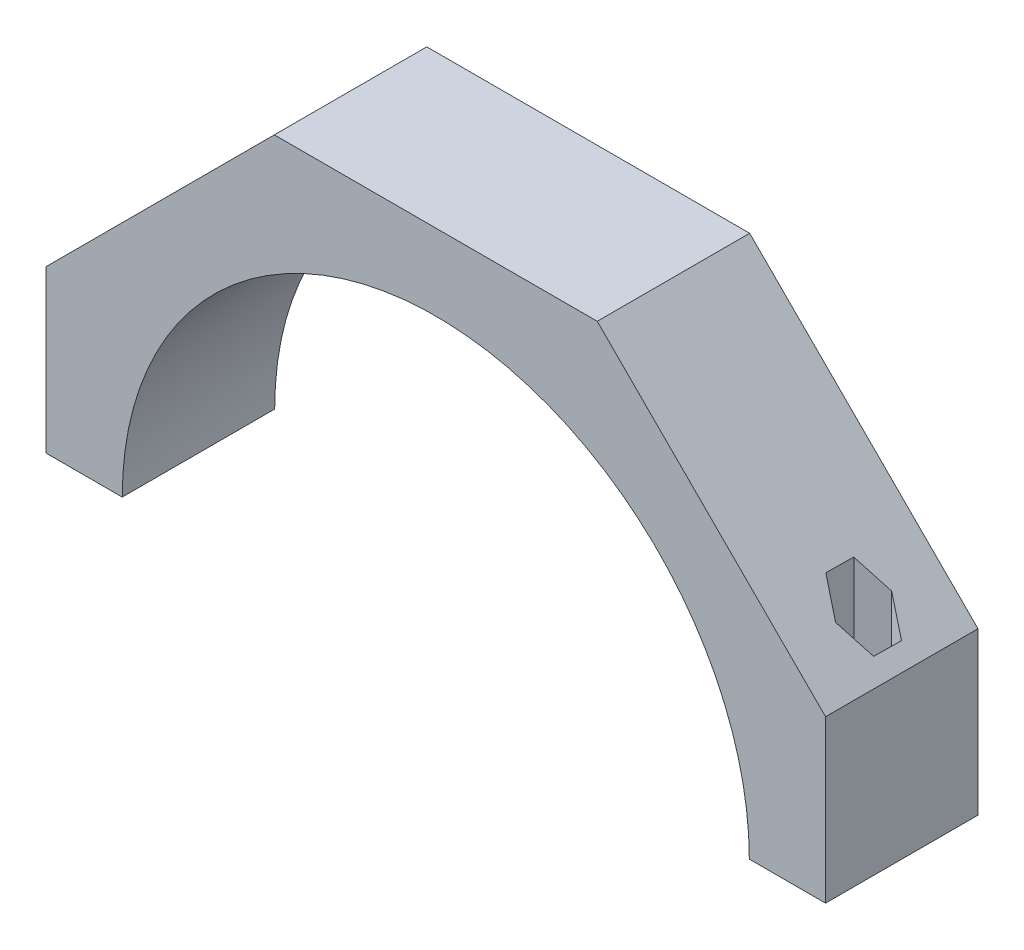
ISO-10303-21;
HEADER;
FILE_DESCRIPTION(('STEP AP214'),'2;1');
FILE_NAME('part.step','',(''),(''),'','','');
FILE_SCHEMA(('AUTOMOTIVE_DESIGN { 1 0 10303 214 1 1 1 1 }'));
ENDSEC;
DATA;
#1=APPLICATION_CONTEXT('core data for automotive mechanical design processes');
#2=APPLICATION_PROTOCOL_DEFINITION('international standard','automotive_design',2000,#1);
#3=PRODUCT_CONTEXT('',#1,'mechanical');
#4=PRODUCT('Part','Part','',(#3));
#5=PRODUCT_RELATED_PRODUCT_CATEGORY('part','',(#4));
#6=PRODUCT_DEFINITION_FORMATION('','',#4);
#7=PRODUCT_DEFINITION_CONTEXT('part definition',#1,'design');
#8=PRODUCT_DEFINITION('design','',#6,#7);
#9=PRODUCT_DEFINITION_SHAPE('','',#8);
#10=(LENGTH_UNIT() NAMED_UNIT(*) SI_UNIT(.MILLI.,.METRE.));
#11=(NAMED_UNIT(*) PLANE_ANGLE_UNIT() SI_UNIT($,.RADIAN.));
#12=(NAMED_UNIT(*) SI_UNIT($,.STERADIAN.) SOLID_ANGLE_UNIT());
#13=UNCERTAINTY_MEASURE_WITH_UNIT(LENGTH_MEASURE(1.E-05),#10,'distance_accuracy_value','');
#14=(GEOMETRIC_REPRESENTATION_CONTEXT(3) GLOBAL_UNCERTAINTY_ASSIGNED_CONTEXT((#13)) GLOBAL_UNIT_ASSIGNED_CONTEXT((#10,
#11,#12)) REPRESENTATION_CONTEXT('',''));
#15=CARTESIAN_POINT('',(0.,0.,0.));
#16=DIRECTION('',(0.,0.,1.));
#17=DIRECTION('',(1.,0.,0.));
#18=AXIS2_PLACEMENT_3D('',#15,#16,#17);
#19=CARTESIAN_POINT('',(0.,0.,19.05));
#20=DIRECTION('',(0.,0.,-1.));
#21=DIRECTION('',(-1.,0.,0.));
#22=AXIS2_PLACEMENT_3D('',#19,#20,#21);
#23=CYLINDRICAL_SURFACE('',#22,78.359);
#24=CARTESIAN_POINT('',(0.,0.,-19.05));
#25=DIRECTION('',(0.,0.,-1.));
#26=DIRECTION('',(1.,0.,0.));
#27=AXIS2_PLACEMENT_3D('',#24,#25,#26);
#28=CIRCLE('',#27,78.359);
#29=CARTESIAN_POINT('',(-78.359,0.,-19.05));
#30=VERTEX_POINT('',#29);
#31=CARTESIAN_POINT('',(78.359,0.,-19.05));
#32=VERTEX_POINT('',#31);
#33=EDGE_CURVE('E144',#30,#32,#28,.T.);
#34=ORIENTED_EDGE('',*,*,#33,.T.);
#35=DIRECTION('',(0.,0.,-1.));
#36=VECTOR('',#35,1.);
#37=CARTESIAN_POINT('',(78.359,0.,19.05));
#38=LINE('',#37,#36);
#39=CARTESIAN_POINT('',(78.359,0.,19.05));
#40=VERTEX_POINT('',#39);
#41=EDGE_CURVE('E173',#40,#32,#38,.T.);
#42=ORIENTED_EDGE('',*,*,#41,.F.);
#43=CARTESIAN_POINT('',(0.,0.,19.05));
#44=DIRECTION('',(0.,0.,-1.));
#45=DIRECTION('',(1.,0.,0.));
#46=AXIS2_PLACEMENT_3D('',#43,#44,#45);
#47=CIRCLE('',#46,78.359);
#48=CARTESIAN_POINT('',(-78.359,0.,19.05));
#49=VERTEX_POINT('',#48);
#50=EDGE_CURVE('E160',#49,#40,#47,.T.);
#51=ORIENTED_EDGE('',*,*,#50,.F.);
#52=DIRECTION('',(0.,0.,-1.));
#53=VECTOR('',#52,1.);
#54=CARTESIAN_POINT('',(-78.359,0.,19.05));
#55=LINE('',#54,#53);
#56=EDGE_CURVE('E140',#49,#30,#55,.T.);
#57=ORIENTED_EDGE('',*,*,#56,.T.);
#58=EDGE_LOOP('',(#34,#42,#51,#57));
#59=FACE_BOUND('',#58,.T.);
#60=ADVANCED_FACE('F36',(#59),#23,.F.);
#61=CARTESIAN_POINT('',(78.359,0.,19.05));
#62=DIRECTION('',(0.,1.,0.));
#63=DIRECTION('',(-1.,0.,0.));
#64=AXIS2_PLACEMENT_3D('',#61,#62,#63);
#65=PLANE('',#64);
#66=CARTESIAN_POINT('',(87.884,0.,0.));
#67=DIRECTION('',(0.,-1.,0.));
#68=DIRECTION('',(0.,0.,-1.));
#69=AXIS2_PLACEMENT_3D('',#66,#67,#68);
#70=CIRCLE('',#69,3.429);
#71=CARTESIAN_POINT('',(87.884,0.,-3.429));
#72=VERTEX_POINT('',#71);
#73=EDGE_CURVE('E186',#72,#72,#70,.T.);
#74=ORIENTED_EDGE('',*,*,#73,.F.);
#75=EDGE_LOOP('',(#74));
#76=FACE_BOUND('',#75,.T.);
#77=DIRECTION('',(1.,0.,0.));
#78=VECTOR('',#77,1.);
#79=CARTESIAN_POINT('',(78.359,0.,-19.05));
#80=LINE('',#79,#78);
#81=CARTESIAN_POINT('',(97.409,0.,-19.05));
#82=VERTEX_POINT('',#81);
#83=EDGE_CURVE('E147',#32,#82,#80,.T.);
#84=ORIENTED_EDGE('',*,*,#83,.T.);
#85=DIRECTION('',(0.,0.,-1.));
#86=VECTOR('',#85,1.);
#87=CARTESIAN_POINT('',(97.409,0.,19.05));
#88=LINE('',#87,#86);
#89=CARTESIAN_POINT('',(97.409,0.,19.05));
#90=VERTEX_POINT('',#89);
#91=EDGE_CURVE('E170',#90,#82,#88,.T.);
#92=ORIENTED_EDGE('',*,*,#91,.F.);
#93=DIRECTION('',(1.,0.,0.));
#94=VECTOR('',#93,1.);
#95=CARTESIAN_POINT('',(78.359,0.,19.05));
#96=LINE('',#95,#94);
#97=EDGE_CURVE('E101',#40,#90,#96,.T.);
#98=ORIENTED_EDGE('',*,*,#97,.F.);
#99=ORIENTED_EDGE('',*,*,#41,.T.);
#100=EDGE_LOOP('',(#84,#92,#98,#99));
#101=FACE_BOUND('',#100,.T.);
#102=ADVANCED_FACE('F263',(#76,#101),#65,.F.);
#103=CARTESIAN_POINT('',(97.409,0.,19.05));
#104=DIRECTION('',(-1.,0.,0.));
#105=DIRECTION('',(0.,0.,1.));
#106=AXIS2_PLACEMENT_3D('',#103,#104,#105);
#107=PLANE('',#106);
#108=DIRECTION('',(0.,1.,0.));
#109=VECTOR('',#108,1.);
#110=CARTESIAN_POINT('',(97.409,0.,-19.05));
#111=LINE('',#110,#109);
#112=CARTESIAN_POINT('',(97.409,40.3481288972009,-19.05));
#113=VERTEX_POINT('',#112);
#114=EDGE_CURVE('E150',#82,#113,#111,.T.);
#115=ORIENTED_EDGE('',*,*,#114,.T.);
#116=DIRECTION('',(0.,0.,-1.));
#117=VECTOR('',#116,1.);
#118=CARTESIAN_POINT('',(97.409,40.3481288972009,19.05));
#119=LINE('',#118,#117);
#120=CARTESIAN_POINT('',(97.409,40.3481288972009,19.05));
#121=VERTEX_POINT('',#120);
#122=EDGE_CURVE('E167',#121,#113,#119,.T.);
#123=ORIENTED_EDGE('',*,*,#122,.F.);
#124=DIRECTION('',(0.,1.,0.));
#125=VECTOR('',#124,1.);
#126=CARTESIAN_POINT('',(97.409,0.,19.05));
#127=LINE('',#126,#125);
#128=EDGE_CURVE('E245',#90,#121,#127,.T.);
#129=ORIENTED_EDGE('',*,*,#128,.F.);
#130=ORIENTED_EDGE('',*,*,#91,.T.);
#131=EDGE_LOOP('',(#115,#123,#129,#130));
#132=FACE_BOUND('',#131,.T.);
#133=ADVANCED_FACE('F266',(#132),#107,.F.);
#134=CARTESIAN_POINT('',(97.409,40.3481288972009,19.05));
#135=DIRECTION('',(-0.707106781186547,-0.707106781186548,0.));
#136=DIRECTION('',(0.707106781186548,-0.707106781186547,0.));
#137=AXIS2_PLACEMENT_3D('',#134,#135,#136);
#138=PLANE('',#137);
#139=DIRECTION('',(0.656228253901727,-0.656228253901725,-0.37246336405368));
#140=VECTOR('',#139,1.);
#141=CARTESIAN_POINT('',(89.7406015644502,48.0165273327507,-7.97128693042852));
#142=LINE('',#141,#140);
#143=CARTESIAN_POINT('',(81.8936901445303,55.8634387526705,-3.51752102273222));
#144=VERTEX_POINT('',#143);
#145=CARTESIAN_POINT('',(87.9351076362971,49.8220212609038,-6.94652102274313));
#146=VERTEX_POINT('',#145);
#147=EDGE_CURVE('E43',#144,#146,#142,.T.);
#148=ORIENTED_EDGE('',*,*,#147,.T.);
#149=DIRECTION('',(0.653050160585475,-0.653050160585473,0.383472261732936));
#150=VECTOR('',#149,1.);
#151=CARTESIAN_POINT('',(102.526075832161,35.2310530650402,1.62132247939293));
#152=LINE('',#151,#150);
#153=CARTESIAN_POINT('',(93.9254174917667,43.8317114054341,-3.42900000001092));
#154=VERTEX_POINT('',#153);
#155=EDGE_CURVE('E11',#146,#154,#152,.T.);
#156=ORIENTED_EDGE('',*,*,#155,.T.);
#157=DIRECTION('',(-0.00735690137628621,0.00735690137628619,0.999945874537357));
#158=VECTOR('',#157,1.);
#159=CARTESIAN_POINT('',(93.7604277475945,43.9967011496064,18.9963127217008));
#160=LINE('',#159,#158);
#161=CARTESIAN_POINT('',(93.8743098554697,43.8828190417312,3.5175210227322));
#162=VERTEX_POINT('',#161);
#163=EDGE_CURVE('E175',#154,#162,#160,.T.);
#164=ORIENTED_EDGE('',*,*,#163,.T.);
#165=DIRECTION('',(-0.656228253901726,0.656228253901725,0.372463364053681));
#166=VECTOR('',#165,1.);
#167=CARTESIAN_POINT('',(93.1221723403449,44.634956556856,3.94442075990246));
#168=LINE('',#167,#166);
#169=CARTESIAN_POINT('',(87.8328923637029,49.9242365334979,6.94652102274312));
#170=VERTEX_POINT('',#169);
#171=EDGE_CURVE('E189',#162,#170,#168,.T.);
#172=ORIENTED_EDGE('',*,*,#171,.T.);
#173=DIRECTION('',(-0.653050160585475,0.653050160585473,-0.383472261732936));
#174=VECTOR('',#173,1.);
#175=CARTESIAN_POINT('',(99.0318573864022,38.7252715107987,13.5225739900564));
#176=LINE('',#175,#174);
#177=CARTESIAN_POINT('',(81.8425825082333,55.9145463889676,3.42900000001091));
#178=VERTEX_POINT('',#177);
#179=EDGE_CURVE('E192',#170,#178,#176,.T.);
#180=ORIENTED_EDGE('',*,*,#179,.T.);
#181=DIRECTION('',(0.0073569013762862,-0.00735690137628618,-0.999945874537357));
#182=VECTOR('',#181,1.);
#183=CARTESIAN_POINT('',(81.7293516055433,56.0277772916575,18.8192802584815));
#184=LINE('',#183,#182);
#185=EDGE_CURVE('E195',#178,#144,#184,.T.);
#186=ORIENTED_EDGE('',*,*,#185,.T.);
#187=EDGE_LOOP('',(#148,#156,#164,#172,#180,#186));
#188=FACE_BOUND('',#187,.T.);
#189=DIRECTION('',(-0.707106781186548,0.707106781186547,0.));
#190=VECTOR('',#189,1.);
#191=CARTESIAN_POINT('',(97.409,40.3481288972009,-19.05));
#192=LINE('',#191,#190);
#193=CARTESIAN_POINT('',(40.3481288972007,97.409,-19.05));
#194=VERTEX_POINT('',#193);
#195=EDGE_CURVE('E152',#113,#194,#192,.T.);
#196=ORIENTED_EDGE('',*,*,#195,.T.);
#197=DIRECTION('',(0.,0.,-1.));
#198=VECTOR('',#197,1.);
#199=CARTESIAN_POINT('',(40.3481288972007,97.409,19.05));
#200=LINE('',#199,#198);
#201=CARTESIAN_POINT('',(40.3481288972007,97.409,19.05));
#202=VERTEX_POINT('',#201);
#203=EDGE_CURVE('E164',#202,#194,#200,.T.);
#204=ORIENTED_EDGE('',*,*,#203,.F.);
#205=DIRECTION('',(-0.707106781186548,0.707106781186547,0.));
#206=VECTOR('',#205,1.);
#207=CARTESIAN_POINT('',(97.409,40.3481288972009,19.05));
#208=LINE('',#207,#206);
#209=EDGE_CURVE('E247',#121,#202,#208,.T.);
#210=ORIENTED_EDGE('',*,*,#209,.F.);
#211=ORIENTED_EDGE('',*,*,#122,.T.);
#212=EDGE_LOOP('',(#196,#204,#210,#211));
#213=FACE_BOUND('',#212,.T.);
#214=ADVANCED_FACE('F200',(#188,#213),#138,.F.);
#215=CARTESIAN_POINT('',(-40.3481288972008,97.409,19.05));
#216=DIRECTION('',(0.,-1.,0.));
#217=DIRECTION('',(0.,0.,-1.));
#218=AXIS2_PLACEMENT_3D('',#215,#216,#217);
#219=PLANE('',#218);
#220=DIRECTION('',(-1.,0.,0.));
#221=VECTOR('',#220,1.);
#222=CARTESIAN_POINT('',(-40.3481288972008,97.409,-19.05));
#223=LINE('',#222,#221);
#224=CARTESIAN_POINT('',(-40.3481288972008,97.409,-19.05));
#225=VERTEX_POINT('',#224);
#226=EDGE_CURVE('E154',#194,#225,#223,.T.);
#227=ORIENTED_EDGE('',*,*,#226,.T.);
#228=DIRECTION('',(0.,0.,-1.));
#229=VECTOR('',#228,1.);
#230=CARTESIAN_POINT('',(-40.3481288972008,97.409,19.05));
#231=LINE('',#230,#229);
#232=CARTESIAN_POINT('',(-40.3481288972008,97.409,19.05));
#233=VERTEX_POINT('',#232);
#234=EDGE_CURVE('E135',#233,#225,#231,.T.);
#235=ORIENTED_EDGE('',*,*,#234,.F.);
#236=DIRECTION('',(-1.,0.,0.));
#237=VECTOR('',#236,1.);
#238=CARTESIAN_POINT('',(-40.3481288972008,97.409,19.05));
#239=LINE('',#238,#237);
#240=EDGE_CURVE('E123',#202,#233,#239,.T.);
#241=ORIENTED_EDGE('',*,*,#240,.F.);
#242=ORIENTED_EDGE('',*,*,#203,.T.);
#243=EDGE_LOOP('',(#227,#235,#241,#242));
#244=FACE_BOUND('',#243,.T.);
#245=ADVANCED_FACE('F255',(#244),#219,.F.);
#246=CARTESIAN_POINT('',(-97.409,40.3481288972009,19.05));
#247=DIRECTION('',(0.707106781186547,-0.707106781186548,0.));
#248=DIRECTION('',(0.707106781186548,0.707106781186547,0.));
#249=AXIS2_PLACEMENT_3D('',#246,#247,#248);
#250=PLANE('',#249);
#251=CARTESIAN_POINT('',(-87.884,49.8731288972009,0.));
#252=DIRECTION('',(0.707106781186547,-0.707106781186548,0.));
#253=DIRECTION('',(-0.707106781186548,-0.707106781186547,0.));
#254=AXIS2_PLACEMENT_3D('',#251,#252,#253);
#255=ELLIPSE('',#254,8.0287082265776,5.67715403118125);
#256=CARTESIAN_POINT('',(-93.5611540311812,44.1959748660196,0.));
#257=VERTEX_POINT('',#256);
#258=EDGE_CURVE('E183',#257,#257,#255,.T.);
#259=ORIENTED_EDGE('',*,*,#258,.T.);
#260=EDGE_LOOP('',(#259));
#261=FACE_BOUND('',#260,.T.);
#262=DIRECTION('',(-0.707106781186548,-0.707106781186547,0.));
#263=VECTOR('',#262,1.);
#264=CARTESIAN_POINT('',(-97.409,40.3481288972009,-19.05));
#265=LINE('',#264,#263);
#266=CARTESIAN_POINT('',(-97.409,40.3481288972009,-19.05));
#267=VERTEX_POINT('',#266);
#268=EDGE_CURVE('E132',#225,#267,#265,.T.);
#269=ORIENTED_EDGE('',*,*,#268,.T.);
#270=DIRECTION('',(0.,0.,-1.));
#271=VECTOR('',#270,1.);
#272=CARTESIAN_POINT('',(-97.409,40.3481288972009,19.05));
#273=LINE('',#272,#271);
#274=CARTESIAN_POINT('',(-97.409,40.3481288972009,19.05));
#275=VERTEX_POINT('',#274);
#276=EDGE_CURVE('E129',#275,#267,#273,.T.);
#277=ORIENTED_EDGE('',*,*,#276,.F.);
#278=DIRECTION('',(-0.707106781186548,-0.707106781186547,0.));
#279=VECTOR('',#278,1.);
#280=CARTESIAN_POINT('',(-97.409,40.3481288972009,19.05));
#281=LINE('',#280,#279);
#282=EDGE_CURVE('E116',#233,#275,#281,.T.);
#283=ORIENTED_EDGE('',*,*,#282,.F.);
#284=ORIENTED_EDGE('',*,*,#234,.T.);
#285=EDGE_LOOP('',(#269,#277,#283,#284));
#286=FACE_BOUND('',#285,.T.);
#287=ADVANCED_FACE('F130',(#261,#286),#250,.F.);
#288=CARTESIAN_POINT('',(-97.409,0.,19.05));
#289=DIRECTION('',(1.,0.,0.));
#290=DIRECTION('',(0.,0.,-1.));
#291=AXIS2_PLACEMENT_3D('',#288,#289,#290);
#292=PLANE('',#291);
#293=DIRECTION('',(0.,-1.,0.));
#294=VECTOR('',#293,1.);
#295=CARTESIAN_POINT('',(-97.409,0.,-19.05));
#296=LINE('',#295,#294);
#297=CARTESIAN_POINT('',(-97.409,0.,-19.05));
#298=VERTEX_POINT('',#297);
#299=EDGE_CURVE('E157',#267,#298,#296,.T.);
#300=ORIENTED_EDGE('',*,*,#299,.T.);
#301=DIRECTION('',(0.,0.,-1.));
#302=VECTOR('',#301,1.);
#303=CARTESIAN_POINT('',(-97.409,0.,19.05));
#304=LINE('',#303,#302);
#305=CARTESIAN_POINT('',(-97.409,0.,19.05));
#306=VERTEX_POINT('',#305);
#307=EDGE_CURVE('E136',#306,#298,#304,.T.);
#308=ORIENTED_EDGE('',*,*,#307,.F.);
#309=DIRECTION('',(0.,-1.,0.));
#310=VECTOR('',#309,1.);
#311=CARTESIAN_POINT('',(-97.409,0.,19.05));
#312=LINE('',#311,#310);
#313=EDGE_CURVE('E120',#275,#306,#312,.T.);
#314=ORIENTED_EDGE('',*,*,#313,.F.);
#315=ORIENTED_EDGE('',*,*,#276,.T.);
#316=EDGE_LOOP('',(#300,#308,#314,#315));
#317=FACE_BOUND('',#316,.T.);
#318=ADVANCED_FACE('F138',(#317),#292,.F.);
#319=CARTESIAN_POINT('',(-78.359,0.,19.05));
#320=DIRECTION('',(0.,1.,0.));
#321=DIRECTION('',(-1.,0.,0.));
#322=AXIS2_PLACEMENT_3D('',#319,#320,#321);
#323=PLANE('',#322);
#324=CARTESIAN_POINT('',(-87.884,0.,0.));
#325=DIRECTION('',(0.,-1.,0.));
#326=DIRECTION('',(0.,0.,-1.));
#327=AXIS2_PLACEMENT_3D('',#324,#325,#326);
#328=CIRCLE('',#327,3.429);
#329=CARTESIAN_POINT('',(-87.884,0.,-3.42900000000002));
#330=VERTEX_POINT('',#329);
#331=EDGE_CURVE('E148',#330,#330,#328,.F.);
#332=ORIENTED_EDGE('',*,*,#331,.T.);
#333=EDGE_LOOP('',(#332));
#334=FACE_BOUND('',#333,.T.);
#335=DIRECTION('',(1.,0.,0.));
#336=VECTOR('',#335,1.);
#337=CARTESIAN_POINT('',(-78.359,0.,-19.05));
#338=LINE('',#337,#336);
#339=EDGE_CURVE('E92',#298,#30,#338,.T.);
#340=ORIENTED_EDGE('',*,*,#339,.T.);
#341=ORIENTED_EDGE('',*,*,#56,.F.);
#342=DIRECTION('',(1.,0.,0.));
#343=VECTOR('',#342,1.);
#344=CARTESIAN_POINT('',(-78.359,0.,19.05));
#345=LINE('',#344,#343);
#346=EDGE_CURVE('E59',#306,#49,#345,.T.);
#347=ORIENTED_EDGE('',*,*,#346,.F.);
#348=ORIENTED_EDGE('',*,*,#307,.T.);
#349=EDGE_LOOP('',(#340,#341,#347,#348));
#350=FACE_BOUND('',#349,.T.);
#351=ADVANCED_FACE('F259',(#334,#350),#323,.F.);
#352=CARTESIAN_POINT('',(0.,0.,19.05));
#353=DIRECTION('',(0.,0.,1.));
#354=DIRECTION('',(1.,0.,0.));
#355=AXIS2_PLACEMENT_3D('',#352,#353,#354);
#356=PLANE('',#355);
#357=ORIENTED_EDGE('',*,*,#50,.T.);
#358=ORIENTED_EDGE('',*,*,#97,.T.);
#359=ORIENTED_EDGE('',*,*,#128,.T.);
#360=ORIENTED_EDGE('',*,*,#209,.T.);
#361=ORIENTED_EDGE('',*,*,#240,.T.);
#362=ORIENTED_EDGE('',*,*,#282,.T.);
#363=ORIENTED_EDGE('',*,*,#313,.T.);
#364=ORIENTED_EDGE('',*,*,#346,.T.);
#365=EDGE_LOOP('',(#357,#358,#359,#360,#361,#362,#363,#364));
#366=FACE_BOUND('',#365,.T.);
#367=ADVANCED_FACE('F118',(#366),#356,.T.);
#368=CARTESIAN_POINT('',(0.,0.,-19.05));
#369=DIRECTION('',(0.,0.,1.));
#370=DIRECTION('',(1.,0.,0.));
#371=AXIS2_PLACEMENT_3D('',#368,#369,#370);
#372=PLANE('',#371);
#373=ORIENTED_EDGE('',*,*,#33,.F.);
#374=ORIENTED_EDGE('',*,*,#339,.F.);
#375=ORIENTED_EDGE('',*,*,#299,.F.);
#376=ORIENTED_EDGE('',*,*,#268,.F.);
#377=ORIENTED_EDGE('',*,*,#226,.F.);
#378=ORIENTED_EDGE('',*,*,#195,.F.);
#379=ORIENTED_EDGE('',*,*,#114,.F.);
#380=ORIENTED_EDGE('',*,*,#83,.F.);
#381=EDGE_LOOP('',(#373,#374,#375,#376,#377,#378,#379,#380));
#382=FACE_BOUND('',#381,.T.);
#383=ADVANCED_FACE('F258',(#382),#372,.F.);
#384=CARTESIAN_POINT('',(-87.884,97.409,0.));
#385=DIRECTION('',(0.,-1.,0.));
#386=DIRECTION('',(0.,0.,-1.));
#387=AXIS2_PLACEMENT_3D('',#384,#385,#386);
#388=CYLINDRICAL_SURFACE('',#387,3.429);
#389=CARTESIAN_POINT('',(-87.884,19.05,0.));
#390=DIRECTION('',(0.,-1.,0.));
#391=DIRECTION('',(0.,0.,-1.));
#392=AXIS2_PLACEMENT_3D('',#389,#390,#391);
#393=CIRCLE('',#392,3.429);
#394=CARTESIAN_POINT('',(-87.884,19.05,-3.42900000000002));
#395=VERTEX_POINT('',#394);
#396=EDGE_CURVE('E179',#395,#395,#393,.T.);
#397=ORIENTED_EDGE('',*,*,#396,.F.);
#398=EDGE_LOOP('',(#397));
#399=FACE_BOUND('',#398,.T.);
#400=ORIENTED_EDGE('',*,*,#331,.F.);
#401=EDGE_LOOP('',(#400));
#402=FACE_BOUND('',#401,.T.);
#403=ADVANCED_FACE('F323',(#399,#402),#388,.F.);
#404=CARTESIAN_POINT('',(87.884,97.409,0.));
#405=DIRECTION('',(0.,-1.,0.));
#406=DIRECTION('',(0.,0.,-1.));
#407=AXIS2_PLACEMENT_3D('',#404,#405,#406);
#408=CYLINDRICAL_SURFACE('',#407,3.429);
#409=CARTESIAN_POINT('',(87.884,19.05,0.));
#410=DIRECTION('',(0.,-1.,0.));
#411=DIRECTION('',(0.,0.,-1.));
#412=AXIS2_PLACEMENT_3D('',#409,#410,#411);
#413=CIRCLE('',#412,3.429);
#414=CARTESIAN_POINT('',(87.884,19.05,-3.429));
#415=VERTEX_POINT('',#414);
#416=EDGE_CURVE('E176',#415,#415,#413,.F.);
#417=ORIENTED_EDGE('',*,*,#416,.T.);
#418=EDGE_LOOP('',(#417));
#419=FACE_BOUND('',#418,.T.);
#420=ORIENTED_EDGE('',*,*,#73,.T.);
#421=EDGE_LOOP('',(#420));
#422=FACE_BOUND('',#421,.T.);
#423=ADVANCED_FACE('F328',(#419,#422),#408,.F.);
#424=CARTESIAN_POINT('',(87.9351076362971,97.409,-6.94652102274313));
#425=DIRECTION('',(0.506357903996156,0.,-0.862323415581775));
#426=DIRECTION('',(-0.862323415581776,0.,-0.506357903996156));
#427=AXIS2_PLACEMENT_3D('',#424,#425,#426);
#428=PLANE('',#427);
#429=DIRECTION('',(0.,-1.,0.));
#430=VECTOR('',#429,1.);
#431=CARTESIAN_POINT('',(87.9351076362971,97.409,-6.94652102274313));
#432=LINE('',#431,#430);
#433=CARTESIAN_POINT('',(87.9351076362971,19.05,-6.94652102274313));
#434=VERTEX_POINT('',#433);
#435=EDGE_CURVE('E216',#146,#434,#432,.T.);
#436=ORIENTED_EDGE('',*,*,#435,.T.);
#437=DIRECTION('',(0.862323415581775,0.,0.506357903996156));
#438=VECTOR('',#437,1.);
#439=CARTESIAN_POINT('',(87.9351076362971,19.05,-6.94652102274313));
#440=LINE('',#439,#438);
#441=CARTESIAN_POINT('',(93.9254174917667,19.05,-3.42900000001092));
#442=VERTEX_POINT('',#441);
#443=EDGE_CURVE('E457',#434,#442,#440,.T.);
#444=ORIENTED_EDGE('',*,*,#443,.T.);
#445=DIRECTION('',(0.,-1.,0.));
#446=VECTOR('',#445,1.);
#447=CARTESIAN_POINT('',(93.9254174917667,97.409,-3.42900000001092));
#448=LINE('',#447,#446);
#449=EDGE_CURVE('E235',#154,#442,#448,.T.);
#450=ORIENTED_EDGE('',*,*,#449,.F.);
#451=ORIENTED_EDGE('',*,*,#155,.F.);
#452=EDGE_LOOP('',(#436,#444,#450,#451));
#453=FACE_BOUND('',#452,.T.);
#454=ADVANCED_FACE('F338',(#453),#428,.F.);
#455=CARTESIAN_POINT('',(81.8936901445303,97.409,-3.51752102273222));
#456=DIRECTION('',(-0.493615032173906,0.,-0.869680516058601));
#457=DIRECTION('',(-0.869680516058601,0.,0.493615032173906));
#458=AXIS2_PLACEMENT_3D('',#455,#456,#457);
#459=PLANE('',#458);
#460=DIRECTION('',(0.,-1.,0.));
#461=VECTOR('',#460,1.);
#462=CARTESIAN_POINT('',(81.8936901445303,97.409,-3.51752102273222));
#463=LINE('',#462,#461);
#464=CARTESIAN_POINT('',(81.8936901445303,19.05,-3.51752102273222));
#465=VERTEX_POINT('',#464);
#466=EDGE_CURVE('E213',#144,#465,#463,.T.);
#467=ORIENTED_EDGE('',*,*,#466,.T.);
#468=DIRECTION('',(0.869680516058601,0.,-0.493615032173906));
#469=VECTOR('',#468,1.);
#470=CARTESIAN_POINT('',(81.8936901445303,19.05,-3.51752102273222));
#471=LINE('',#470,#469);
#472=EDGE_CURVE('E238',#465,#434,#471,.T.);
#473=ORIENTED_EDGE('',*,*,#472,.T.);
#474=ORIENTED_EDGE('',*,*,#435,.F.);
#475=ORIENTED_EDGE('',*,*,#147,.F.);
#476=EDGE_LOOP('',(#467,#473,#474,#475));
#477=FACE_BOUND('',#476,.T.);
#478=ADVANCED_FACE('F210',(#477),#459,.F.);
#479=CARTESIAN_POINT('',(81.8425825082333,97.409,3.42900000001091));
#480=DIRECTION('',(-0.999972936170061,0.,-0.0073571004768255));
#481=DIRECTION('',(-0.0073571004768255,0.,0.999972936170062));
#482=AXIS2_PLACEMENT_3D('',#479,#480,#481);
#483=PLANE('',#482);
#484=DIRECTION('',(0.,-1.,0.));
#485=VECTOR('',#484,1.);
#486=CARTESIAN_POINT('',(81.8425825082333,97.409,3.42900000001091));
#487=LINE('',#486,#485);
#488=CARTESIAN_POINT('',(81.8425825082333,19.05,3.42900000001091));
#489=VERTEX_POINT('',#488);
#490=EDGE_CURVE('E225',#178,#489,#487,.T.);
#491=ORIENTED_EDGE('',*,*,#490,.T.);
#492=DIRECTION('',(0.0073571004768255,0.,-0.999972936170062));
#493=VECTOR('',#492,1.);
#494=CARTESIAN_POINT('',(81.8425825082333,19.05,3.42900000001091));
#495=LINE('',#494,#493);
#496=EDGE_CURVE('E223',#489,#465,#495,.T.);
#497=ORIENTED_EDGE('',*,*,#496,.T.);
#498=ORIENTED_EDGE('',*,*,#466,.F.);
#499=ORIENTED_EDGE('',*,*,#185,.F.);
#500=EDGE_LOOP('',(#491,#497,#498,#499));
#501=FACE_BOUND('',#500,.T.);
#502=ADVANCED_FACE('F220',(#501),#483,.F.);
#503=CARTESIAN_POINT('',(87.8328923637029,97.409,6.94652102274312));
#504=DIRECTION('',(-0.506357903996156,0.,0.862323415581775));
#505=DIRECTION('',(0.862323415581776,0.,0.506357903996156));
#506=AXIS2_PLACEMENT_3D('',#503,#504,#505);
#507=PLANE('',#506);
#508=DIRECTION('',(0.,-1.,0.));
#509=VECTOR('',#508,1.);
#510=CARTESIAN_POINT('',(87.8328923637029,97.409,6.94652102274312));
#511=LINE('',#510,#509);
#512=CARTESIAN_POINT('',(87.8328923637029,19.05,6.94652102274312));
#513=VERTEX_POINT('',#512);
#514=EDGE_CURVE('E228',#170,#513,#511,.T.);
#515=ORIENTED_EDGE('',*,*,#514,.T.);
#516=DIRECTION('',(-0.862323415581775,0.,-0.506357903996156));
#517=VECTOR('',#516,1.);
#518=CARTESIAN_POINT('',(87.8328923637029,19.05,6.94652102274312));
#519=LINE('',#518,#517);
#520=EDGE_CURVE('E465',#513,#489,#519,.T.);
#521=ORIENTED_EDGE('',*,*,#520,.T.);
#522=ORIENTED_EDGE('',*,*,#490,.F.);
#523=ORIENTED_EDGE('',*,*,#179,.F.);
#524=EDGE_LOOP('',(#515,#521,#522,#523));
#525=FACE_BOUND('',#524,.T.);
#526=ADVANCED_FACE('F365',(#525),#507,.F.);
#527=CARTESIAN_POINT('',(93.8743098554697,97.409,3.5175210227322));
#528=DIRECTION('',(0.493615032173907,0.,0.8696805160586));
#529=DIRECTION('',(0.8696805160586,0.,-0.493615032173907));
#530=AXIS2_PLACEMENT_3D('',#527,#528,#529);
#531=PLANE('',#530);
#532=DIRECTION('',(0.,-1.,0.));
#533=VECTOR('',#532,1.);
#534=CARTESIAN_POINT('',(93.8743098554697,97.409,3.5175210227322));
#535=LINE('',#534,#533);
#536=CARTESIAN_POINT('',(93.8743098554697,19.05,3.5175210227322));
#537=VERTEX_POINT('',#536);
#538=EDGE_CURVE('E50',#162,#537,#535,.T.);
#539=ORIENTED_EDGE('',*,*,#538,.T.);
#540=DIRECTION('',(-0.8696805160586,0.,0.493615032173907));
#541=VECTOR('',#540,1.);
#542=CARTESIAN_POINT('',(93.8743098554697,19.05,3.5175210227322));
#543=LINE('',#542,#541);
#544=EDGE_CURVE('E462',#537,#513,#543,.T.);
#545=ORIENTED_EDGE('',*,*,#544,.T.);
#546=ORIENTED_EDGE('',*,*,#514,.F.);
#547=ORIENTED_EDGE('',*,*,#171,.F.);
#548=EDGE_LOOP('',(#539,#545,#546,#547));
#549=FACE_BOUND('',#548,.T.);
#550=ADVANCED_FACE('F374',(#549),#531,.F.);
#551=CARTESIAN_POINT('',(93.9254174917667,97.409,-3.42900000001092));
#552=DIRECTION('',(0.999972936170061,0.,0.00735710047682551));
#553=DIRECTION('',(0.00735710047682551,0.,-0.999972936170062));
#554=AXIS2_PLACEMENT_3D('',#551,#552,#553);
#555=PLANE('',#554);
#556=ORIENTED_EDGE('',*,*,#449,.T.);
#557=DIRECTION('',(-0.00735710047682551,0.,0.999972936170061));
#558=VECTOR('',#557,1.);
#559=CARTESIAN_POINT('',(93.9254174917667,19.05,-3.42900000001092));
#560=LINE('',#559,#558);
#561=EDGE_CURVE('E460',#442,#537,#560,.T.);
#562=ORIENTED_EDGE('',*,*,#561,.T.);
#563=ORIENTED_EDGE('',*,*,#538,.F.);
#564=ORIENTED_EDGE('',*,*,#163,.F.);
#565=EDGE_LOOP('',(#556,#562,#563,#564));
#566=FACE_BOUND('',#565,.T.);
#567=ADVANCED_FACE('F384',(#566),#555,.F.);
#568=CARTESIAN_POINT('',(0.,19.05,0.));
#569=DIRECTION('',(0.,-1.,0.));
#570=DIRECTION('',(0.,0.,-1.));
#571=AXIS2_PLACEMENT_3D('',#568,#569,#570);
#572=PLANE('',#571);
#573=ORIENTED_EDGE('',*,*,#443,.F.);
#574=ORIENTED_EDGE('',*,*,#472,.F.);
#575=ORIENTED_EDGE('',*,*,#496,.F.);
#576=ORIENTED_EDGE('',*,*,#520,.F.);
#577=ORIENTED_EDGE('',*,*,#544,.F.);
#578=ORIENTED_EDGE('',*,*,#561,.F.);
#579=EDGE_LOOP('',(#573,#574,#575,#576,#577,#578));
#580=FACE_BOUND('',#579,.T.);
#581=ORIENTED_EDGE('',*,*,#416,.F.);
#582=EDGE_LOOP('',(#581));
#583=FACE_BOUND('',#582,.T.);
#584=ADVANCED_FACE('F394',(#580,#583),#572,.F.);
#585=CARTESIAN_POINT('',(-87.884,97.409,0.));
#586=DIRECTION('',(0.,-1.,0.));
#587=DIRECTION('',(0.,0.,-1.));
#588=AXIS2_PLACEMENT_3D('',#585,#586,#587);
#589=CYLINDRICAL_SURFACE('',#588,5.67715403118125);
#590=CARTESIAN_POINT('',(-87.884,19.05,0.));
#591=DIRECTION('',(0.,-1.,0.));
#592=DIRECTION('',(0.,0.,-1.));
#593=AXIS2_PLACEMENT_3D('',#590,#591,#592);
#594=CIRCLE('',#593,5.67715403118125);
#595=CARTESIAN_POINT('',(-87.884,19.05,-5.67715403118127));
#596=VERTEX_POINT('',#595);
#597=EDGE_CURVE('E180',#596,#596,#594,.T.);
#598=ORIENTED_EDGE('',*,*,#597,.T.);
#599=EDGE_LOOP('',(#598));
#600=FACE_BOUND('',#599,.T.);
#601=ORIENTED_EDGE('',*,*,#258,.F.);
#602=EDGE_LOOP('',(#601));
#603=FACE_BOUND('',#602,.T.);
#604=ADVANCED_FACE('F403',(#600,#603),#589,.F.);
#605=CARTESIAN_POINT('',(-87.884,19.05,0.));
#606=DIRECTION('',(0.,-1.,0.));
#607=DIRECTION('',(0.,0.,-1.));
#608=AXIS2_PLACEMENT_3D('',#605,#606,#607);
#609=PLANE('',#608);
#610=ORIENTED_EDGE('',*,*,#396,.T.);
#611=EDGE_LOOP('',(#610));
#612=FACE_BOUND('',#611,.T.);
#613=ORIENTED_EDGE('',*,*,#597,.F.);
#614=EDGE_LOOP('',(#613));
#615=FACE_BOUND('',#614,.T.);
#616=ADVANCED_FACE('F413',(#612,#615),#609,.F.);
#617=CLOSED_SHELL('',(#60,#102,#133,#214,#245,#287,#318,#351,#367,#383,#403,#423,#454,#478,#502,
#526,#550,#567,#584,#604,#616));
#618=MANIFOLD_SOLID_BREP('B2',#617);
#619=ADVANCED_BREP_SHAPE_REPRESENTATION('',(#18,#618),#14);
#620=SHAPE_DEFINITION_REPRESENTATION(#9,#619);
ENDSEC;
END-ISO-10303-21;
